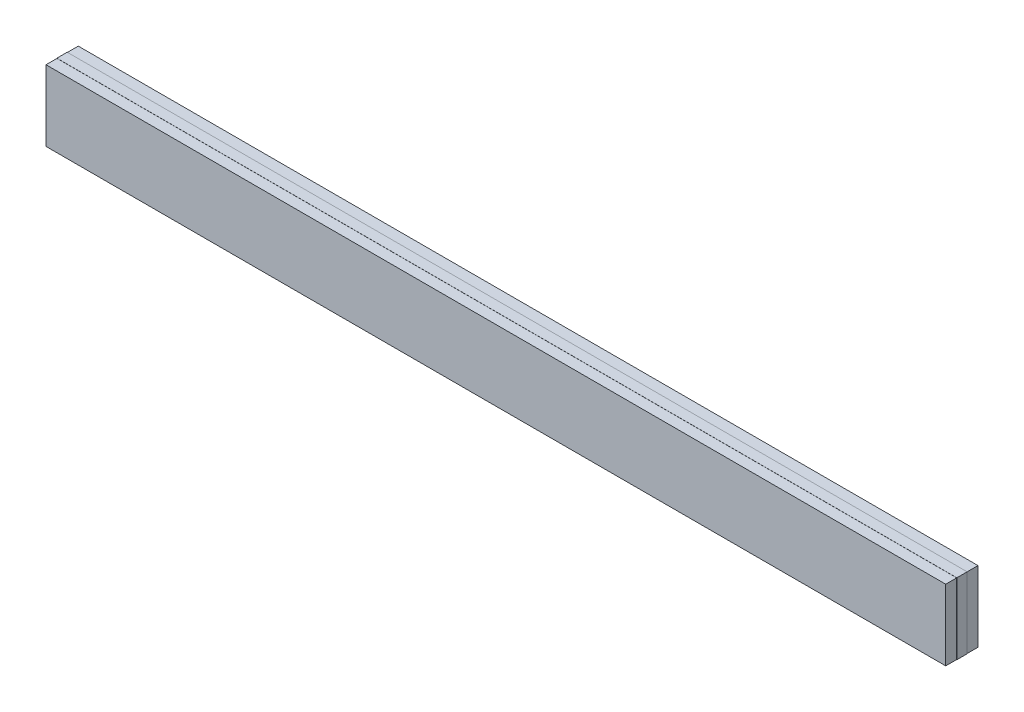
ISO-10303-21;
HEADER;
FILE_DESCRIPTION(('STEP AP214'),'2;1');
FILE_NAME('part.step','',(''),(''),'','','');
FILE_SCHEMA(('AUTOMOTIVE_DESIGN { 1 0 10303 214 1 1 1 1 }'));
ENDSEC;
DATA;
#1=APPLICATION_CONTEXT('core data for automotive mechanical design processes');
#2=APPLICATION_PROTOCOL_DEFINITION('international standard','automotive_design',2000,#1);
#3=PRODUCT_CONTEXT('',#1,'mechanical');
#4=PRODUCT('Part','Part','',(#3));
#5=PRODUCT_RELATED_PRODUCT_CATEGORY('part','',(#4));
#6=PRODUCT_DEFINITION_FORMATION('','',#4);
#7=PRODUCT_DEFINITION_CONTEXT('part definition',#1,'design');
#8=PRODUCT_DEFINITION('design','',#6,#7);
#9=PRODUCT_DEFINITION_SHAPE('','',#8);
#10=(LENGTH_UNIT() NAMED_UNIT(*) SI_UNIT(.MILLI.,.METRE.));
#11=(NAMED_UNIT(*) PLANE_ANGLE_UNIT() SI_UNIT($,.RADIAN.));
#12=(NAMED_UNIT(*) SI_UNIT($,.STERADIAN.) SOLID_ANGLE_UNIT());
#13=UNCERTAINTY_MEASURE_WITH_UNIT(LENGTH_MEASURE(1.E-05),#10,'distance_accuracy_value','');
#14=(GEOMETRIC_REPRESENTATION_CONTEXT(3) GLOBAL_UNCERTAINTY_ASSIGNED_CONTEXT((#13)) GLOBAL_UNIT_ASSIGNED_CONTEXT((#10,
#11,#12)) REPRESENTATION_CONTEXT('',''));
#15=CARTESIAN_POINT('',(0.,0.,0.));
#16=DIRECTION('',(0.,0.,1.));
#17=DIRECTION('',(1.,0.,0.));
#18=AXIS2_PLACEMENT_3D('',#15,#16,#17);
#19=CARTESIAN_POINT('',(0.,0.,-0.399999999999999));
#20=DIRECTION('',(0.,0.,1.));
#21=DIRECTION('',(1.,0.,0.));
#22=AXIS2_PLACEMENT_3D('',#19,#20,#21);
#23=PLANE('',#22);
#24=DIRECTION('',(0.,1.,0.));
#25=VECTOR('',#24,1.);
#26=CARTESIAN_POINT('',(34.85,2.75,-0.399999999999999));
#27=LINE('',#26,#25);
#28=CARTESIAN_POINT('',(34.85,-2.75,-0.399999999999999));
#29=VERTEX_POINT('',#28);
#30=CARTESIAN_POINT('',(34.85,2.75,-0.399999999999999));
#31=VERTEX_POINT('',#30);
#32=EDGE_CURVE('E176',#29,#31,#27,.T.);
#33=ORIENTED_EDGE('',*,*,#32,.F.);
#34=DIRECTION('',(1.,0.,0.));
#35=VECTOR('',#34,1.);
#36=CARTESIAN_POINT('',(-34.85,-2.75,-0.399999999999999));
#37=LINE('',#36,#35);
#38=CARTESIAN_POINT('',(-34.85,-2.75,-0.399999999999999));
#39=VERTEX_POINT('',#38);
#40=EDGE_CURVE('E181',#39,#29,#37,.T.);
#41=ORIENTED_EDGE('',*,*,#40,.F.);
#42=DIRECTION('',(0.,-1.,0.));
#43=VECTOR('',#42,1.);
#44=CARTESIAN_POINT('',(-34.85,2.75,-0.399999999999999));
#45=LINE('',#44,#43);
#46=CARTESIAN_POINT('',(-34.85,2.75,-0.399999999999999));
#47=VERTEX_POINT('',#46);
#48=EDGE_CURVE('E192',#47,#39,#45,.T.);
#49=ORIENTED_EDGE('',*,*,#48,.F.);
#50=DIRECTION('',(-1.,0.,0.));
#51=VECTOR('',#50,1.);
#52=CARTESIAN_POINT('',(-34.85,2.75,-0.399999999999999));
#53=LINE('',#52,#51);
#54=EDGE_CURVE('E190',#31,#47,#53,.T.);
#55=ORIENTED_EDGE('',*,*,#54,.F.);
#56=EDGE_LOOP('',(#33,#41,#49,#55));
#57=FACE_BOUND('',#56,.T.);
#58=DIRECTION('',(1.,0.,0.));
#59=VECTOR('',#58,1.);
#60=CARTESIAN_POINT('',(-34.84,2.74,-0.399999999999999));
#61=LINE('',#60,#59);
#62=CARTESIAN_POINT('',(-34.84,2.74,-0.399999999999999));
#63=VERTEX_POINT('',#62);
#64=CARTESIAN_POINT('',(34.84,2.74,-0.399999999999999));
#65=VERTEX_POINT('',#64);
#66=EDGE_CURVE('E141',#63,#65,#61,.T.);
#67=ORIENTED_EDGE('',*,*,#66,.F.);
#68=DIRECTION('',(0.,1.,0.));
#69=VECTOR('',#68,1.);
#70=CARTESIAN_POINT('',(-34.84,-2.74,-0.399999999999999));
#71=LINE('',#70,#69);
#72=CARTESIAN_POINT('',(-34.84,-2.74,-0.399999999999999));
#73=VERTEX_POINT('',#72);
#74=EDGE_CURVE('E138',#73,#63,#71,.T.);
#75=ORIENTED_EDGE('',*,*,#74,.F.);
#76=DIRECTION('',(-1.,0.,0.));
#77=VECTOR('',#76,1.);
#78=CARTESIAN_POINT('',(34.84,-2.74,-0.399999999999999));
#79=LINE('',#78,#77);
#80=CARTESIAN_POINT('',(34.84,-2.74,-0.399999999999999));
#81=VERTEX_POINT('',#80);
#82=EDGE_CURVE('E52',#81,#73,#79,.T.);
#83=ORIENTED_EDGE('',*,*,#82,.F.);
#84=DIRECTION('',(0.,-1.,0.));
#85=VECTOR('',#84,1.);
#86=CARTESIAN_POINT('',(34.84,2.74,-0.399999999999999));
#87=LINE('',#86,#85);
#88=EDGE_CURVE('E47',#65,#81,#87,.T.);
#89=ORIENTED_EDGE('',*,*,#88,.F.);
#90=EDGE_LOOP('',(#67,#75,#83,#89));
#91=FACE_BOUND('',#90,.T.);
#92=ADVANCED_FACE('F32',(#57,#91),#23,.F.);
#93=CARTESIAN_POINT('',(0.,0.,0.399999999999999));
#94=DIRECTION('',(0.,0.,1.));
#95=DIRECTION('',(1.,0.,0.));
#96=AXIS2_PLACEMENT_3D('',#93,#94,#95);
#97=PLANE('',#96);
#98=DIRECTION('',(0.,1.,0.));
#99=VECTOR('',#98,1.);
#100=CARTESIAN_POINT('',(34.85,2.75,0.399999999999999));
#101=LINE('',#100,#99);
#102=CARTESIAN_POINT('',(34.85,-2.75,0.399999999999999));
#103=VERTEX_POINT('',#102);
#104=CARTESIAN_POINT('',(34.85,2.75,0.399999999999999));
#105=VERTEX_POINT('',#104);
#106=EDGE_CURVE('E177',#103,#105,#101,.T.);
#107=ORIENTED_EDGE('',*,*,#106,.T.);
#108=DIRECTION('',(-1.,0.,0.));
#109=VECTOR('',#108,1.);
#110=CARTESIAN_POINT('',(-34.85,2.75,0.399999999999999));
#111=LINE('',#110,#109);
#112=CARTESIAN_POINT('',(-34.85,2.75,0.399999999999999));
#113=VERTEX_POINT('',#112);
#114=EDGE_CURVE('E180',#105,#113,#111,.T.);
#115=ORIENTED_EDGE('',*,*,#114,.T.);
#116=DIRECTION('',(0.,-1.,0.));
#117=VECTOR('',#116,1.);
#118=CARTESIAN_POINT('',(-34.85,2.75,0.399999999999999));
#119=LINE('',#118,#117);
#120=CARTESIAN_POINT('',(-34.85,-2.75,0.399999999999999));
#121=VERTEX_POINT('',#120);
#122=EDGE_CURVE('E183',#113,#121,#119,.T.);
#123=ORIENTED_EDGE('',*,*,#122,.T.);
#124=DIRECTION('',(1.,0.,0.));
#125=VECTOR('',#124,1.);
#126=CARTESIAN_POINT('',(-34.85,-2.75,0.399999999999999));
#127=LINE('',#126,#125);
#128=EDGE_CURVE('E185',#121,#103,#127,.T.);
#129=ORIENTED_EDGE('',*,*,#128,.T.);
#130=EDGE_LOOP('',(#107,#115,#123,#129));
#131=FACE_BOUND('',#130,.T.);
#132=DIRECTION('',(0.,1.,0.));
#133=VECTOR('',#132,1.);
#134=CARTESIAN_POINT('',(34.84,-2.74,0.399999999999999));
#135=LINE('',#134,#133);
#136=CARTESIAN_POINT('',(34.84,-2.74,0.399999999999999));
#137=VERTEX_POINT('',#136);
#138=CARTESIAN_POINT('',(34.84,2.74,0.399999999999999));
#139=VERTEX_POINT('',#138);
#140=EDGE_CURVE('E145',#137,#139,#135,.T.);
#141=ORIENTED_EDGE('',*,*,#140,.F.);
#142=DIRECTION('',(1.,0.,0.));
#143=VECTOR('',#142,1.);
#144=CARTESIAN_POINT('',(-34.84,-2.74,0.399999999999999));
#145=LINE('',#144,#143);
#146=CARTESIAN_POINT('',(-34.84,-2.74,0.399999999999999));
#147=VERTEX_POINT('',#146);
#148=EDGE_CURVE('E142',#147,#137,#145,.T.);
#149=ORIENTED_EDGE('',*,*,#148,.F.);
#150=DIRECTION('',(0.,-1.,0.));
#151=VECTOR('',#150,1.);
#152=CARTESIAN_POINT('',(-34.84,2.74,0.399999999999999));
#153=LINE('',#152,#151);
#154=CARTESIAN_POINT('',(-34.84,2.74,0.399999999999999));
#155=VERTEX_POINT('',#154);
#156=EDGE_CURVE('E155',#155,#147,#153,.T.);
#157=ORIENTED_EDGE('',*,*,#156,.F.);
#158=DIRECTION('',(-1.,0.,0.));
#159=VECTOR('',#158,1.);
#160=CARTESIAN_POINT('',(34.84,2.74,0.399999999999999));
#161=LINE('',#160,#159);
#162=EDGE_CURVE('E163',#139,#155,#161,.T.);
#163=ORIENTED_EDGE('',*,*,#162,.F.);
#164=EDGE_LOOP('',(#141,#149,#157,#163));
#165=FACE_BOUND('',#164,.T.);
#166=ADVANCED_FACE('F218',(#131,#165),#97,.T.);
#167=CARTESIAN_POINT('',(34.85,2.75,0.399999999999999));
#168=DIRECTION('',(-1.,0.,0.));
#169=DIRECTION('',(0.,0.,1.));
#170=AXIS2_PLACEMENT_3D('',#167,#168,#169);
#171=PLANE('',#170);
#172=ORIENTED_EDGE('',*,*,#32,.T.);
#173=DIRECTION('',(0.,0.,-1.));
#174=VECTOR('',#173,1.);
#175=CARTESIAN_POINT('',(34.85,2.75,0.399999999999999));
#176=LINE('',#175,#174);
#177=EDGE_CURVE('E11',#105,#31,#176,.T.);
#178=ORIENTED_EDGE('',*,*,#177,.F.);
#179=ORIENTED_EDGE('',*,*,#106,.F.);
#180=DIRECTION('',(0.,0.,-1.));
#181=VECTOR('',#180,1.);
#182=CARTESIAN_POINT('',(34.85,-2.75,0.399999999999999));
#183=LINE('',#182,#181);
#184=EDGE_CURVE('E187',#103,#29,#183,.T.);
#185=ORIENTED_EDGE('',*,*,#184,.T.);
#186=EDGE_LOOP('',(#172,#178,#179,#185));
#187=FACE_BOUND('',#186,.T.);
#188=ADVANCED_FACE('F34',(#187),#171,.F.);
#189=CARTESIAN_POINT('',(-34.85,2.75,0.399999999999999));
#190=DIRECTION('',(0.,-1.,0.));
#191=DIRECTION('',(0.,0.,-1.));
#192=AXIS2_PLACEMENT_3D('',#189,#190,#191);
#193=PLANE('',#192);
#194=ORIENTED_EDGE('',*,*,#54,.T.);
#195=DIRECTION('',(0.,0.,-1.));
#196=VECTOR('',#195,1.);
#197=CARTESIAN_POINT('',(-34.85,2.75,0.399999999999999));
#198=LINE('',#197,#196);
#199=EDGE_CURVE('E40',#113,#47,#198,.T.);
#200=ORIENTED_EDGE('',*,*,#199,.F.);
#201=ORIENTED_EDGE('',*,*,#114,.F.);
#202=ORIENTED_EDGE('',*,*,#177,.T.);
#203=EDGE_LOOP('',(#194,#200,#201,#202));
#204=FACE_BOUND('',#203,.T.);
#205=ADVANCED_FACE('F220',(#204),#193,.F.);
#206=CARTESIAN_POINT('',(-34.85,2.75,0.399999999999999));
#207=DIRECTION('',(1.,0.,0.));
#208=DIRECTION('',(0.,0.,-1.));
#209=AXIS2_PLACEMENT_3D('',#206,#207,#208);
#210=PLANE('',#209);
#211=ORIENTED_EDGE('',*,*,#48,.T.);
#212=DIRECTION('',(0.,0.,-1.));
#213=VECTOR('',#212,1.);
#214=CARTESIAN_POINT('',(-34.85,-2.75,0.399999999999999));
#215=LINE('',#214,#213);
#216=EDGE_CURVE('E197',#121,#39,#215,.T.);
#217=ORIENTED_EDGE('',*,*,#216,.F.);
#218=ORIENTED_EDGE('',*,*,#122,.F.);
#219=ORIENTED_EDGE('',*,*,#199,.T.);
#220=EDGE_LOOP('',(#211,#217,#218,#219));
#221=FACE_BOUND('',#220,.T.);
#222=ADVANCED_FACE('F204',(#221),#210,.F.);
#223=CARTESIAN_POINT('',(-34.85,-2.75,0.399999999999999));
#224=DIRECTION('',(0.,1.,0.));
#225=DIRECTION('',(0.,0.,1.));
#226=AXIS2_PLACEMENT_3D('',#223,#224,#225);
#227=PLANE('',#226);
#228=ORIENTED_EDGE('',*,*,#40,.T.);
#229=ORIENTED_EDGE('',*,*,#184,.F.);
#230=ORIENTED_EDGE('',*,*,#128,.F.);
#231=ORIENTED_EDGE('',*,*,#216,.T.);
#232=EDGE_LOOP('',(#228,#229,#230,#231));
#233=FACE_BOUND('',#232,.T.);
#234=ADVANCED_FACE('F212',(#233),#227,.F.);
#235=CARTESIAN_POINT('',(-34.84,-2.74,1.25));
#236=DIRECTION('',(0.,1.,0.));
#237=DIRECTION('',(0.,0.,1.));
#238=AXIS2_PLACEMENT_3D('',#235,#236,#237);
#239=PLANE('',#238);
#240=ORIENTED_EDGE('',*,*,#148,.T.);
#241=DIRECTION('',(0.,0.,-1.));
#242=VECTOR('',#241,1.);
#243=CARTESIAN_POINT('',(34.84,-2.74,1.25));
#244=LINE('',#243,#242);
#245=CARTESIAN_POINT('',(34.84,-2.74,1.25));
#246=VERTEX_POINT('',#245);
#247=EDGE_CURVE('E174',#246,#137,#244,.T.);
#248=ORIENTED_EDGE('',*,*,#247,.F.);
#249=DIRECTION('',(1.,0.,0.));
#250=VECTOR('',#249,1.);
#251=CARTESIAN_POINT('',(-34.84,-2.74,1.25));
#252=LINE('',#251,#250);
#253=CARTESIAN_POINT('',(-34.84,-2.74,1.25));
#254=VERTEX_POINT('',#253);
#255=EDGE_CURVE('E151',#254,#246,#252,.T.);
#256=ORIENTED_EDGE('',*,*,#255,.F.);
#257=DIRECTION('',(0.,0.,-1.));
#258=VECTOR('',#257,1.);
#259=CARTESIAN_POINT('',(-34.84,-2.74,1.25));
#260=LINE('',#259,#258);
#261=EDGE_CURVE('E160',#254,#147,#260,.T.);
#262=ORIENTED_EDGE('',*,*,#261,.T.);
#263=EDGE_LOOP('',(#240,#248,#256,#262));
#264=FACE_BOUND('',#263,.T.);
#265=ADVANCED_FACE('F236',(#264),#239,.F.);
#266=CARTESIAN_POINT('',(34.84,-2.74,1.25));
#267=DIRECTION('',(-1.,0.,0.));
#268=DIRECTION('',(0.,0.,1.));
#269=AXIS2_PLACEMENT_3D('',#266,#267,#268);
#270=PLANE('',#269);
#271=ORIENTED_EDGE('',*,*,#140,.T.);
#272=DIRECTION('',(0.,0.,-1.));
#273=VECTOR('',#272,1.);
#274=CARTESIAN_POINT('',(34.84,2.74,1.25));
#275=LINE('',#274,#273);
#276=CARTESIAN_POINT('',(34.84,2.74,1.25));
#277=VERTEX_POINT('',#276);
#278=EDGE_CURVE('E171',#277,#139,#275,.T.);
#279=ORIENTED_EDGE('',*,*,#278,.F.);
#280=DIRECTION('',(0.,1.,0.));
#281=VECTOR('',#280,1.);
#282=CARTESIAN_POINT('',(34.84,-2.74,1.25));
#283=LINE('',#282,#281);
#284=EDGE_CURVE('E154',#246,#277,#283,.T.);
#285=ORIENTED_EDGE('',*,*,#284,.F.);
#286=ORIENTED_EDGE('',*,*,#247,.T.);
#287=EDGE_LOOP('',(#271,#279,#285,#286));
#288=FACE_BOUND('',#287,.T.);
#289=ADVANCED_FACE('F240',(#288),#270,.F.);
#290=CARTESIAN_POINT('',(34.84,2.74,1.25));
#291=DIRECTION('',(0.,-1.,0.));
#292=DIRECTION('',(0.,0.,-1.));
#293=AXIS2_PLACEMENT_3D('',#290,#291,#292);
#294=PLANE('',#293);
#295=ORIENTED_EDGE('',*,*,#162,.T.);
#296=DIRECTION('',(0.,0.,-1.));
#297=VECTOR('',#296,1.);
#298=CARTESIAN_POINT('',(-34.84,2.74,1.25));
#299=LINE('',#298,#297);
#300=CARTESIAN_POINT('',(-34.84,2.74,1.25));
#301=VERTEX_POINT('',#300);
#302=EDGE_CURVE('E169',#301,#155,#299,.T.);
#303=ORIENTED_EDGE('',*,*,#302,.F.);
#304=DIRECTION('',(-1.,0.,0.));
#305=VECTOR('',#304,1.);
#306=CARTESIAN_POINT('',(34.84,2.74,1.25));
#307=LINE('',#306,#305);
#308=EDGE_CURVE('E157',#277,#301,#307,.T.);
#309=ORIENTED_EDGE('',*,*,#308,.F.);
#310=ORIENTED_EDGE('',*,*,#278,.T.);
#311=EDGE_LOOP('',(#295,#303,#309,#310));
#312=FACE_BOUND('',#311,.T.);
#313=ADVANCED_FACE('F245',(#312),#294,.F.);
#314=CARTESIAN_POINT('',(-34.84,2.74,1.25));
#315=DIRECTION('',(1.,0.,0.));
#316=DIRECTION('',(0.,0.,-1.));
#317=AXIS2_PLACEMENT_3D('',#314,#315,#316);
#318=PLANE('',#317);
#319=ORIENTED_EDGE('',*,*,#156,.T.);
#320=ORIENTED_EDGE('',*,*,#261,.F.);
#321=DIRECTION('',(0.,-1.,0.));
#322=VECTOR('',#321,1.);
#323=CARTESIAN_POINT('',(-34.84,2.74,1.25));
#324=LINE('',#323,#322);
#325=EDGE_CURVE('E159',#301,#254,#324,.T.);
#326=ORIENTED_EDGE('',*,*,#325,.F.);
#327=ORIENTED_EDGE('',*,*,#302,.T.);
#328=EDGE_LOOP('',(#319,#320,#326,#327));
#329=FACE_BOUND('',#328,.T.);
#330=ADVANCED_FACE('F251',(#329),#318,.F.);
#331=CARTESIAN_POINT('',(0.,0.,1.25));
#332=DIRECTION('',(0.,0.,1.));
#333=DIRECTION('',(1.,0.,0.));
#334=AXIS2_PLACEMENT_3D('',#331,#332,#333);
#335=PLANE('',#334);
#336=ORIENTED_EDGE('',*,*,#255,.T.);
#337=ORIENTED_EDGE('',*,*,#284,.T.);
#338=ORIENTED_EDGE('',*,*,#308,.T.);
#339=ORIENTED_EDGE('',*,*,#325,.T.);
#340=EDGE_LOOP('',(#336,#337,#338,#339));
#341=FACE_BOUND('',#340,.T.);
#342=ADVANCED_FACE('F255',(#341),#335,.T.);
#343=CARTESIAN_POINT('',(-34.84,2.74,-1.25));
#344=DIRECTION('',(0.,-1.,0.));
#345=DIRECTION('',(0.,0.,-1.));
#346=AXIS2_PLACEMENT_3D('',#343,#344,#345);
#347=PLANE('',#346);
#348=ORIENTED_EDGE('',*,*,#66,.T.);
#349=DIRECTION('',(0.,0.,1.));
#350=VECTOR('',#349,1.);
#351=CARTESIAN_POINT('',(34.84,2.74,-1.25));
#352=LINE('',#351,#350);
#353=CARTESIAN_POINT('',(34.84,2.74,-1.25));
#354=VERTEX_POINT('',#353);
#355=EDGE_CURVE('E122',#354,#65,#352,.T.);
#356=ORIENTED_EDGE('',*,*,#355,.F.);
#357=DIRECTION('',(1.,0.,0.));
#358=VECTOR('',#357,1.);
#359=CARTESIAN_POINT('',(-34.84,2.74,-1.25));
#360=LINE('',#359,#358);
#361=CARTESIAN_POINT('',(-34.84,2.74,-1.25));
#362=VERTEX_POINT('',#361);
#363=EDGE_CURVE('E129',#362,#354,#360,.T.);
#364=ORIENTED_EDGE('',*,*,#363,.F.);
#365=DIRECTION('',(0.,0.,1.));
#366=VECTOR('',#365,1.);
#367=CARTESIAN_POINT('',(-34.84,2.74,-1.25));
#368=LINE('',#367,#366);
#369=EDGE_CURVE('E331',#362,#63,#368,.T.);
#370=ORIENTED_EDGE('',*,*,#369,.T.);
#371=EDGE_LOOP('',(#348,#356,#364,#370));
#372=FACE_BOUND('',#371,.T.);
#373=ADVANCED_FACE('F140',(#372),#347,.F.);
#374=CARTESIAN_POINT('',(34.84,2.74,-1.25));
#375=DIRECTION('',(-1.,0.,0.));
#376=DIRECTION('',(0.,0.,1.));
#377=AXIS2_PLACEMENT_3D('',#374,#375,#376);
#378=PLANE('',#377);
#379=ORIENTED_EDGE('',*,*,#88,.T.);
#380=DIRECTION('',(0.,0.,1.));
#381=VECTOR('',#380,1.);
#382=CARTESIAN_POINT('',(34.84,-2.74,-1.25));
#383=LINE('',#382,#381);
#384=CARTESIAN_POINT('',(34.84,-2.74,-1.25));
#385=VERTEX_POINT('',#384);
#386=EDGE_CURVE('E125',#385,#81,#383,.T.);
#387=ORIENTED_EDGE('',*,*,#386,.F.);
#388=DIRECTION('',(0.,-1.,0.));
#389=VECTOR('',#388,1.);
#390=CARTESIAN_POINT('',(34.84,2.74,-1.25));
#391=LINE('',#390,#389);
#392=EDGE_CURVE('E118',#354,#385,#391,.T.);
#393=ORIENTED_EDGE('',*,*,#392,.F.);
#394=ORIENTED_EDGE('',*,*,#355,.T.);
#395=EDGE_LOOP('',(#379,#387,#393,#394));
#396=FACE_BOUND('',#395,.T.);
#397=ADVANCED_FACE('F120',(#396),#378,.F.);
#398=CARTESIAN_POINT('',(34.84,-2.74,-1.25));
#399=DIRECTION('',(0.,1.,0.));
#400=DIRECTION('',(0.,0.,1.));
#401=AXIS2_PLACEMENT_3D('',#398,#399,#400);
#402=PLANE('',#401);
#403=ORIENTED_EDGE('',*,*,#82,.T.);
#404=DIRECTION('',(0.,0.,1.));
#405=VECTOR('',#404,1.);
#406=CARTESIAN_POINT('',(-34.84,-2.74,-1.25));
#407=LINE('',#406,#405);
#408=CARTESIAN_POINT('',(-34.84,-2.74,-1.25));
#409=VERTEX_POINT('',#408);
#410=EDGE_CURVE('E147',#409,#73,#407,.T.);
#411=ORIENTED_EDGE('',*,*,#410,.F.);
#412=DIRECTION('',(-1.,0.,0.));
#413=VECTOR('',#412,1.);
#414=CARTESIAN_POINT('',(34.84,-2.74,-1.25));
#415=LINE('',#414,#413);
#416=EDGE_CURVE('E128',#385,#409,#415,.T.);
#417=ORIENTED_EDGE('',*,*,#416,.F.);
#418=ORIENTED_EDGE('',*,*,#386,.T.);
#419=EDGE_LOOP('',(#403,#411,#417,#418));
#420=FACE_BOUND('',#419,.T.);
#421=ADVANCED_FACE('F264',(#420),#402,.F.);
#422=CARTESIAN_POINT('',(-34.84,-2.74,-1.25));
#423=DIRECTION('',(1.,0.,0.));
#424=DIRECTION('',(0.,0.,-1.));
#425=AXIS2_PLACEMENT_3D('',#422,#423,#424);
#426=PLANE('',#425);
#427=ORIENTED_EDGE('',*,*,#74,.T.);
#428=ORIENTED_EDGE('',*,*,#369,.F.);
#429=DIRECTION('',(0.,1.,0.));
#430=VECTOR('',#429,1.);
#431=CARTESIAN_POINT('',(-34.84,-2.74,-1.25));
#432=LINE('',#431,#430);
#433=EDGE_CURVE('E134',#409,#362,#432,.T.);
#434=ORIENTED_EDGE('',*,*,#433,.F.);
#435=ORIENTED_EDGE('',*,*,#410,.T.);
#436=EDGE_LOOP('',(#427,#428,#434,#435));
#437=FACE_BOUND('',#436,.T.);
#438=ADVANCED_FACE('F267',(#437),#426,.F.);
#439=CARTESIAN_POINT('',(0.,0.,-1.25));
#440=DIRECTION('',(0.,0.,-1.));
#441=DIRECTION('',(-1.,0.,0.));
#442=AXIS2_PLACEMENT_3D('',#439,#440,#441);
#443=PLANE('',#442);
#444=ORIENTED_EDGE('',*,*,#363,.T.);
#445=ORIENTED_EDGE('',*,*,#392,.T.);
#446=ORIENTED_EDGE('',*,*,#416,.T.);
#447=ORIENTED_EDGE('',*,*,#433,.T.);
#448=EDGE_LOOP('',(#444,#445,#446,#447));
#449=FACE_BOUND('',#448,.T.);
#450=ADVANCED_FACE('F132',(#449),#443,.T.);
#451=CLOSED_SHELL('',(#92,#166,#188,#205,#222,#234,#265,#289,#313,#330,#342,#373,#397,#421,#438,#450));
#452=MANIFOLD_SOLID_BREP('B2',#451);
#453=ADVANCED_BREP_SHAPE_REPRESENTATION('',(#18,#452),#14);
#454=SHAPE_DEFINITION_REPRESENTATION(#9,#453);
ENDSEC;
END-ISO-10303-21;
